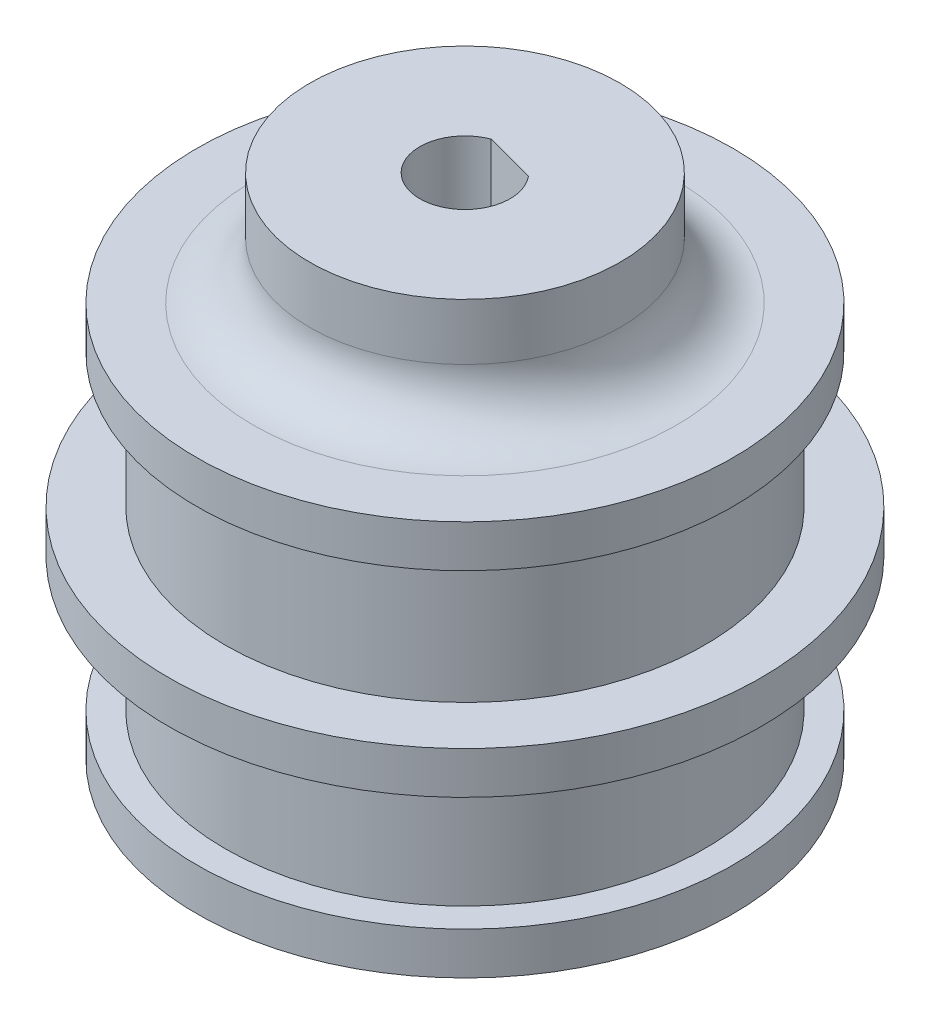
ISO-10303-21;
HEADER;
FILE_DESCRIPTION(('STEP AP214'),'2;1');
FILE_NAME('part.step','',(''),(''),'','','');
FILE_SCHEMA(('AUTOMOTIVE_DESIGN { 1 0 10303 214 1 1 1 1 }'));
ENDSEC;
DATA;
#1=APPLICATION_CONTEXT('core data for automotive mechanical design processes');
#2=APPLICATION_PROTOCOL_DEFINITION('international standard','automotive_design',2000,#1);
#3=PRODUCT_CONTEXT('',#1,'mechanical');
#4=PRODUCT('Part','Part','',(#3));
#5=PRODUCT_RELATED_PRODUCT_CATEGORY('part','',(#4));
#6=PRODUCT_DEFINITION_FORMATION('','',#4);
#7=PRODUCT_DEFINITION_CONTEXT('part definition',#1,'design');
#8=PRODUCT_DEFINITION('design','',#6,#7);
#9=PRODUCT_DEFINITION_SHAPE('','',#8);
#10=(LENGTH_UNIT() NAMED_UNIT(*) SI_UNIT(.MILLI.,.METRE.));
#11=(NAMED_UNIT(*) PLANE_ANGLE_UNIT() SI_UNIT($,.RADIAN.));
#12=(NAMED_UNIT(*) SI_UNIT($,.STERADIAN.) SOLID_ANGLE_UNIT());
#13=UNCERTAINTY_MEASURE_WITH_UNIT(LENGTH_MEASURE(1.E-05),#10,'distance_accuracy_value','');
#14=(GEOMETRIC_REPRESENTATION_CONTEXT(3) GLOBAL_UNCERTAINTY_ASSIGNED_CONTEXT((#13)) GLOBAL_UNIT_ASSIGNED_CONTEXT((#10,
#11,#12)) REPRESENTATION_CONTEXT('',''));
#15=CARTESIAN_POINT('',(0.,0.,0.));
#16=DIRECTION('',(0.,0.,1.));
#17=DIRECTION('',(1.,0.,0.));
#18=AXIS2_PLACEMENT_3D('',#15,#16,#17);
#19=CARTESIAN_POINT('',(7.5,-4.79917699236291,0.));
#20=DIRECTION('',(0.,-1.,0.));
#21=DIRECTION('',(0.,0.,-1.));
#22=AXIS2_PLACEMENT_3D('',#19,#20,#21);
#23=PLANE('',#22);
#24=CARTESIAN_POINT('',(0.,-4.79917699236291,0.));
#25=DIRECTION('',(0.,-1.,0.));
#26=DIRECTION('',(0.,0.,-1.));
#27=AXIS2_PLACEMENT_3D('',#24,#25,#26);
#28=CIRCLE('',#27,9.5);
#29=CARTESIAN_POINT('',(0.,-4.79917699236291,-9.5));
#30=VERTEX_POINT('',#29);
#31=EDGE_CURVE('E113',#30,#30,#28,.T.);
#32=ORIENTED_EDGE('',*,*,#31,.T.);
#33=EDGE_LOOP('',(#32));
#34=FACE_BOUND('',#33,.T.);
#35=CARTESIAN_POINT('',(0.,-4.79917699236291,0.));
#36=DIRECTION('',(0.,-1.,0.));
#37=DIRECTION('',(0.,0.,-1.));
#38=AXIS2_PLACEMENT_3D('',#35,#36,#37);
#39=CIRCLE('',#38,7.5);
#40=CARTESIAN_POINT('',(0.,-4.79917699236291,-7.5));
#41=VERTEX_POINT('',#40);
#42=EDGE_CURVE('E62',#41,#41,#39,.T.);
#43=ORIENTED_EDGE('',*,*,#42,.F.);
#44=EDGE_LOOP('',(#43));
#45=FACE_BOUND('',#44,.T.);
#46=ADVANCED_FACE('F33',(#34,#45),#23,.T.);
#47=CARTESIAN_POINT('',(0.,-15.7831074618265,0.));
#48=DIRECTION('',(0.,-1.,0.));
#49=DIRECTION('',(0.,0.,-1.));
#50=AXIS2_PLACEMENT_3D('',#47,#48,#49);
#51=CYLINDRICAL_SURFACE('',#50,9.5);
#52=CARTESIAN_POINT('',(0.,-3.2991769923629,0.));
#53=DIRECTION('',(0.,-1.,0.));
#54=DIRECTION('',(0.,0.,-1.));
#55=AXIS2_PLACEMENT_3D('',#52,#53,#54);
#56=CIRCLE('',#55,9.5);
#57=CARTESIAN_POINT('',(0.,-3.2991769923629,-9.5));
#58=VERTEX_POINT('',#57);
#59=EDGE_CURVE('E110',#58,#58,#56,.T.);
#60=ORIENTED_EDGE('',*,*,#59,.T.);
#61=EDGE_LOOP('',(#60));
#62=FACE_BOUND('',#61,.T.);
#63=ORIENTED_EDGE('',*,*,#31,.F.);
#64=EDGE_LOOP('',(#63));
#65=FACE_BOUND('',#64,.T.);
#66=ADVANCED_FACE('F139',(#62,#65),#51,.T.);
#67=CARTESIAN_POINT('',(9.5,-3.29917699236291,0.));
#68=DIRECTION('',(0.,1.,0.));
#69=DIRECTION('',(0.,0.,1.));
#70=AXIS2_PLACEMENT_3D('',#67,#68,#69);
#71=PLANE('',#70);
#72=CARTESIAN_POINT('',(0.,-3.29917699236291,0.));
#73=DIRECTION('',(0.,-1.,0.));
#74=DIRECTION('',(0.,0.,-1.));
#75=AXIS2_PLACEMENT_3D('',#72,#73,#74);
#76=CIRCLE('',#75,8.5);
#77=CARTESIAN_POINT('',(0.,-3.29917699236291,-8.5));
#78=VERTEX_POINT('',#77);
#79=EDGE_CURVE('E107',#78,#78,#76,.T.);
#80=ORIENTED_EDGE('',*,*,#79,.T.);
#81=EDGE_LOOP('',(#80));
#82=FACE_BOUND('',#81,.T.);
#83=ORIENTED_EDGE('',*,*,#59,.F.);
#84=EDGE_LOOP('',(#83));
#85=FACE_BOUND('',#84,.T.);
#86=ADVANCED_FACE('F144',(#82,#85),#71,.T.);
#87=CARTESIAN_POINT('',(0.,-15.7831074618265,0.));
#88=DIRECTION('',(0.,-1.,0.));
#89=DIRECTION('',(0.,0.,-1.));
#90=AXIS2_PLACEMENT_3D('',#87,#88,#89);
#91=CYLINDRICAL_SURFACE('',#90,8.5);
#92=CARTESIAN_POINT('',(0.,1.4508230076371,0.));
#93=DIRECTION('',(0.,-1.,0.));
#94=DIRECTION('',(0.,0.,-1.));
#95=AXIS2_PLACEMENT_3D('',#92,#93,#94);
#96=CIRCLE('',#95,8.5);
#97=CARTESIAN_POINT('',(0.,1.4508230076371,-8.5));
#98=VERTEX_POINT('',#97);
#99=EDGE_CURVE('E104',#98,#98,#96,.T.);
#100=ORIENTED_EDGE('',*,*,#99,.T.);
#101=EDGE_LOOP('',(#100));
#102=FACE_BOUND('',#101,.T.);
#103=ORIENTED_EDGE('',*,*,#79,.F.);
#104=EDGE_LOOP('',(#103));
#105=FACE_BOUND('',#104,.T.);
#106=ADVANCED_FACE('F151',(#102,#105),#91,.T.);
#107=CARTESIAN_POINT('',(8.5,1.45082300763709,0.));
#108=DIRECTION('',(0.,-1.,0.));
#109=DIRECTION('',(0.,0.,-1.));
#110=AXIS2_PLACEMENT_3D('',#107,#108,#109);
#111=PLANE('',#110);
#112=CARTESIAN_POINT('',(0.,1.4508230076371,0.));
#113=DIRECTION('',(0.,-1.,0.));
#114=DIRECTION('',(0.,0.,-1.));
#115=AXIS2_PLACEMENT_3D('',#112,#113,#114);
#116=CIRCLE('',#115,10.5);
#117=CARTESIAN_POINT('',(0.,1.4508230076371,-10.5));
#118=VERTEX_POINT('',#117);
#119=EDGE_CURVE('E101',#118,#118,#116,.T.);
#120=ORIENTED_EDGE('',*,*,#119,.T.);
#121=EDGE_LOOP('',(#120));
#122=FACE_BOUND('',#121,.T.);
#123=ORIENTED_EDGE('',*,*,#99,.F.);
#124=EDGE_LOOP('',(#123));
#125=FACE_BOUND('',#124,.T.);
#126=ADVANCED_FACE('F155',(#122,#125),#111,.T.);
#127=CARTESIAN_POINT('',(0.,-15.7831074618265,0.));
#128=DIRECTION('',(0.,-1.,0.));
#129=DIRECTION('',(0.,0.,-1.));
#130=AXIS2_PLACEMENT_3D('',#127,#128,#129);
#131=CYLINDRICAL_SURFACE('',#130,10.5);
#132=CARTESIAN_POINT('',(0.,2.95082300763709,0.));
#133=DIRECTION('',(0.,-1.,0.));
#134=DIRECTION('',(0.,0.,-1.));
#135=AXIS2_PLACEMENT_3D('',#132,#133,#134);
#136=CIRCLE('',#135,10.5);
#137=CARTESIAN_POINT('',(0.,2.95082300763709,-10.5));
#138=VERTEX_POINT('',#137);
#139=EDGE_CURVE('E98',#138,#138,#136,.T.);
#140=ORIENTED_EDGE('',*,*,#139,.T.);
#141=EDGE_LOOP('',(#140));
#142=FACE_BOUND('',#141,.T.);
#143=ORIENTED_EDGE('',*,*,#119,.F.);
#144=EDGE_LOOP('',(#143));
#145=FACE_BOUND('',#144,.T.);
#146=ADVANCED_FACE('F159',(#142,#145),#131,.T.);
#147=CARTESIAN_POINT('',(10.5,2.95082300763709,0.));
#148=DIRECTION('',(0.,1.,0.));
#149=DIRECTION('',(0.,0.,1.));
#150=AXIS2_PLACEMENT_3D('',#147,#148,#149);
#151=PLANE('',#150);
#152=CARTESIAN_POINT('',(0.,2.95082300763709,0.));
#153=DIRECTION('',(0.,-1.,0.));
#154=DIRECTION('',(0.,0.,-1.));
#155=AXIS2_PLACEMENT_3D('',#152,#153,#154);
#156=CIRCLE('',#155,8.5);
#157=CARTESIAN_POINT('',(0.,2.95082300763709,-8.5));
#158=VERTEX_POINT('',#157);
#159=EDGE_CURVE('E95',#158,#158,#156,.T.);
#160=ORIENTED_EDGE('',*,*,#159,.T.);
#161=EDGE_LOOP('',(#160));
#162=FACE_BOUND('',#161,.T.);
#163=ORIENTED_EDGE('',*,*,#139,.F.);
#164=EDGE_LOOP('',(#163));
#165=FACE_BOUND('',#164,.T.);
#166=ADVANCED_FACE('F163',(#162,#165),#151,.T.);
#167=CARTESIAN_POINT('',(0.,-15.7831074618265,0.));
#168=DIRECTION('',(0.,-1.,0.));
#169=DIRECTION('',(0.,0.,-1.));
#170=AXIS2_PLACEMENT_3D('',#167,#168,#169);
#171=CYLINDRICAL_SURFACE('',#170,8.5);
#172=CARTESIAN_POINT('',(0.,7.7008230076371,0.));
#173=DIRECTION('',(0.,-1.,0.));
#174=DIRECTION('',(0.,0.,-1.));
#175=AXIS2_PLACEMENT_3D('',#172,#173,#174);
#176=CIRCLE('',#175,8.5);
#177=CARTESIAN_POINT('',(0.,7.7008230076371,-8.5));
#178=VERTEX_POINT('',#177);
#179=EDGE_CURVE('E92',#178,#178,#176,.T.);
#180=ORIENTED_EDGE('',*,*,#179,.T.);
#181=EDGE_LOOP('',(#180));
#182=FACE_BOUND('',#181,.T.);
#183=ORIENTED_EDGE('',*,*,#159,.F.);
#184=EDGE_LOOP('',(#183));
#185=FACE_BOUND('',#184,.T.);
#186=ADVANCED_FACE('F167',(#182,#185),#171,.T.);
#187=CARTESIAN_POINT('',(8.5,7.7008230076371,0.));
#188=DIRECTION('',(0.,-1.,0.));
#189=DIRECTION('',(0.,0.,-1.));
#190=AXIS2_PLACEMENT_3D('',#187,#188,#189);
#191=PLANE('',#190);
#192=CARTESIAN_POINT('',(0.,7.7008230076371,0.));
#193=DIRECTION('',(0.,-1.,0.));
#194=DIRECTION('',(0.,0.,-1.));
#195=AXIS2_PLACEMENT_3D('',#192,#193,#194);
#196=CIRCLE('',#195,9.5);
#197=CARTESIAN_POINT('',(0.,7.7008230076371,-9.5));
#198=VERTEX_POINT('',#197);
#199=EDGE_CURVE('E89',#198,#198,#196,.T.);
#200=ORIENTED_EDGE('',*,*,#199,.T.);
#201=EDGE_LOOP('',(#200));
#202=FACE_BOUND('',#201,.T.);
#203=ORIENTED_EDGE('',*,*,#179,.F.);
#204=EDGE_LOOP('',(#203));
#205=FACE_BOUND('',#204,.T.);
#206=ADVANCED_FACE('F171',(#202,#205),#191,.T.);
#207=CARTESIAN_POINT('',(0.,-15.7831074618265,0.));
#208=DIRECTION('',(0.,-1.,0.));
#209=DIRECTION('',(0.,0.,-1.));
#210=AXIS2_PLACEMENT_3D('',#207,#208,#209);
#211=CYLINDRICAL_SURFACE('',#210,9.5);
#212=CARTESIAN_POINT('',(0.,9.2008230076371,0.));
#213=DIRECTION('',(0.,-1.,0.));
#214=DIRECTION('',(0.,0.,-1.));
#215=AXIS2_PLACEMENT_3D('',#212,#213,#214);
#216=CIRCLE('',#215,9.5);
#217=CARTESIAN_POINT('',(0.,9.2008230076371,-9.5));
#218=VERTEX_POINT('',#217);
#219=EDGE_CURVE('E86',#218,#218,#216,.T.);
#220=ORIENTED_EDGE('',*,*,#219,.T.);
#221=EDGE_LOOP('',(#220));
#222=FACE_BOUND('',#221,.T.);
#223=ORIENTED_EDGE('',*,*,#199,.F.);
#224=EDGE_LOOP('',(#223));
#225=FACE_BOUND('',#224,.T.);
#226=ADVANCED_FACE('F175',(#222,#225),#211,.T.);
#227=CARTESIAN_POINT('',(9.5,9.2008230076371,0.));
#228=DIRECTION('',(0.,1.,0.));
#229=DIRECTION('',(0.,0.,1.));
#230=AXIS2_PLACEMENT_3D('',#227,#228,#229);
#231=PLANE('',#230);
#232=CARTESIAN_POINT('',(0.,9.2008230076371,0.));
#233=DIRECTION('',(0.,1.,0.));
#234=DIRECTION('',(0.,0.,1.));
#235=AXIS2_PLACEMENT_3D('',#232,#233,#234);
#236=CIRCLE('',#235,7.5);
#237=CARTESIAN_POINT('',(0.,9.2008230076371,7.5));
#238=VERTEX_POINT('',#237);
#239=EDGE_CURVE('E116',#238,#238,#236,.F.);
#240=ORIENTED_EDGE('',*,*,#239,.T.);
#241=EDGE_LOOP('',(#240));
#242=FACE_BOUND('',#241,.T.);
#243=ORIENTED_EDGE('',*,*,#219,.F.);
#244=EDGE_LOOP('',(#243));
#245=FACE_BOUND('',#244,.T.);
#246=ADVANCED_FACE('F179',(#242,#245),#231,.T.);
#247=CARTESIAN_POINT('',(0.,-15.7831074618265,0.));
#248=DIRECTION('',(0.,-1.,0.));
#249=DIRECTION('',(0.,0.,-1.));
#250=AXIS2_PLACEMENT_3D('',#247,#248,#249);
#251=CYLINDRICAL_SURFACE('',#250,5.5);
#252=CARTESIAN_POINT('',(0.,11.2008230076371,0.));
#253=DIRECTION('',(0.,1.,0.));
#254=DIRECTION('',(0.,0.,1.));
#255=AXIS2_PLACEMENT_3D('',#252,#253,#254);
#256=CIRCLE('',#255,5.5);
#257=CARTESIAN_POINT('',(0.,11.2008230076371,5.5));
#258=VERTEX_POINT('',#257);
#259=EDGE_CURVE('E119',#258,#258,#256,.T.);
#260=ORIENTED_EDGE('',*,*,#259,.T.);
#261=EDGE_LOOP('',(#260));
#262=FACE_BOUND('',#261,.T.);
#263=CARTESIAN_POINT('',(0.,13.2008230076371,0.));
#264=DIRECTION('',(0.,-1.,0.));
#265=DIRECTION('',(0.,0.,-1.));
#266=AXIS2_PLACEMENT_3D('',#263,#264,#265);
#267=CIRCLE('',#266,5.5);
#268=CARTESIAN_POINT('',(0.,13.2008230076371,-5.5));
#269=VERTEX_POINT('',#268);
#270=EDGE_CURVE('E83',#269,#269,#267,.T.);
#271=ORIENTED_EDGE('',*,*,#270,.T.);
#272=EDGE_LOOP('',(#271));
#273=FACE_BOUND('',#272,.T.);
#274=ADVANCED_FACE('F183',(#262,#273),#251,.T.);
#275=CARTESIAN_POINT('',(5.5,13.2008230076371,0.));
#276=DIRECTION('',(0.,1.,0.));
#277=DIRECTION('',(0.,0.,1.));
#278=AXIS2_PLACEMENT_3D('',#275,#276,#277);
#279=PLANE('',#278);
#280=CARTESIAN_POINT('',(0.,13.2008230076371,0.));
#281=DIRECTION('',(0.,1.,0.));
#282=DIRECTION('',(0.,0.,-1.));
#283=AXIS2_PLACEMENT_3D('',#280,#281,#282);
#284=CIRCLE('',#283,1.6);
#285=CARTESIAN_POINT('',(-0.568761348028621,13.2008230076371,-1.4954967499091));
#286=VERTEX_POINT('',#285);
#287=CARTESIAN_POINT('',(1.23452055077082,13.2008230076371,-1.01782071590458));
#288=VERTEX_POINT('',#287);
#289=EDGE_CURVE('E48',#286,#288,#284,.T.);
#290=ORIENTED_EDGE('',*,*,#289,.F.);
#291=DIRECTION('',(-0.96666056377449,0.,-0.256061231823923));
#292=VECTOR('',#291,1.);
#293=CARTESIAN_POINT('',(-0.568761348028621,13.2008230076371,-1.4954967499091));
#294=LINE('',#293,#292);
#295=EDGE_CURVE('E66',#288,#286,#294,.T.);
#296=ORIENTED_EDGE('',*,*,#295,.F.);
#297=EDGE_LOOP('',(#290,#296));
#298=FACE_BOUND('',#297,.T.);
#299=ORIENTED_EDGE('',*,*,#270,.F.);
#300=EDGE_LOOP('',(#299));
#301=FACE_BOUND('',#300,.T.);
#302=ADVANCED_FACE('F70',(#298,#301),#279,.T.);
#303=CARTESIAN_POINT('',(3.49999999999997,4.20082300763709,0.));
#304=DIRECTION('',(0.,-1.,0.));
#305=DIRECTION('',(0.,0.,-1.));
#306=AXIS2_PLACEMENT_3D('',#303,#304,#305);
#307=PLANE('',#306);
#308=CARTESIAN_POINT('',(0.,4.20082300763709,0.));
#309=DIRECTION('',(0.,-1.,0.));
#310=DIRECTION('',(0.,0.,-1.));
#311=AXIS2_PLACEMENT_3D('',#308,#309,#310);
#312=CIRCLE('',#311,1.6);
#313=CARTESIAN_POINT('',(1.23452055077082,4.20082300763709,-1.01782071590458));
#314=VERTEX_POINT('',#313);
#315=CARTESIAN_POINT('',(-0.568761348028621,4.20082300763709,-1.4954967499091));
#316=VERTEX_POINT('',#315);
#317=EDGE_CURVE('E11',#314,#316,#312,.T.);
#318=ORIENTED_EDGE('',*,*,#317,.F.);
#319=DIRECTION('',(0.96666056377449,0.,0.256061231823923));
#320=VECTOR('',#319,1.);
#321=CARTESIAN_POINT('',(3.60339386081993,4.20082300763709,-0.390323701401882));
#322=LINE('',#321,#320);
#323=EDGE_CURVE('E41',#316,#314,#322,.T.);
#324=ORIENTED_EDGE('',*,*,#323,.F.);
#325=EDGE_LOOP('',(#318,#324));
#326=FACE_BOUND('',#325,.T.);
#327=CARTESIAN_POINT('',(0.,4.20082300763709,0.));
#328=DIRECTION('',(0.,-1.,0.));
#329=DIRECTION('',(0.,0.,-1.));
#330=AXIS2_PLACEMENT_3D('',#327,#328,#329);
#331=CIRCLE('',#330,3.49999999999997);
#332=CARTESIAN_POINT('',(0.,4.20082300763709,-3.49999999999997));
#333=VERTEX_POINT('',#332);
#334=EDGE_CURVE('E80',#333,#333,#331,.T.);
#335=ORIENTED_EDGE('',*,*,#334,.T.);
#336=EDGE_LOOP('',(#335));
#337=FACE_BOUND('',#336,.T.);
#338=ADVANCED_FACE('F122',(#326,#337),#307,.T.);
#339=CARTESIAN_POINT('',(0.,0.200823007637093,0.));
#340=DIRECTION('',(0.,-1.,0.));
#341=DIRECTION('',(0.,0.,-1.));
#342=AXIS2_PLACEMENT_3D('',#339,#340,#341);
#343=DEGENERATE_TOROIDAL_SURFACE('',#342,3.5,4.,.T.);
#344=CARTESIAN_POINT('',(0.,0.200823007637064,0.));
#345=DIRECTION('',(0.,-1.,0.));
#346=DIRECTION('',(0.,0.,-1.));
#347=AXIS2_PLACEMENT_3D('',#344,#345,#346);
#348=CIRCLE('',#347,7.5);
#349=CARTESIAN_POINT('',(0.,0.200823007637064,-7.5));
#350=VERTEX_POINT('',#349);
#351=EDGE_CURVE('E77',#350,#350,#348,.T.);
#352=ORIENTED_EDGE('',*,*,#351,.T.);
#353=EDGE_LOOP('',(#352));
#354=FACE_BOUND('',#353,.T.);
#355=ORIENTED_EDGE('',*,*,#334,.F.);
#356=EDGE_LOOP('',(#355));
#357=FACE_BOUND('',#356,.T.);
#358=ADVANCED_FACE('F125',(#354,#357),#343,.F.);
#359=CARTESIAN_POINT('',(0.,-15.7831074618265,0.));
#360=DIRECTION('',(0.,-1.,0.));
#361=DIRECTION('',(0.,0.,-1.));
#362=AXIS2_PLACEMENT_3D('',#359,#360,#361);
#363=CYLINDRICAL_SURFACE('',#362,7.5);
#364=ORIENTED_EDGE('',*,*,#42,.T.);
#365=EDGE_LOOP('',(#364));
#366=FACE_BOUND('',#365,.T.);
#367=ORIENTED_EDGE('',*,*,#351,.F.);
#368=EDGE_LOOP('',(#367));
#369=FACE_BOUND('',#368,.T.);
#370=ADVANCED_FACE('F130',(#366,#369),#363,.F.);
#371=CARTESIAN_POINT('',(0.,11.2008230076371,0.));
#372=DIRECTION('',(0.,1.,0.));
#373=DIRECTION('',(0.,0.,1.));
#374=AXIS2_PLACEMENT_3D('',#371,#372,#373);
#375=TOROIDAL_SURFACE('',#374,7.5,2.);
#376=ORIENTED_EDGE('',*,*,#259,.F.);
#377=EDGE_LOOP('',(#376));
#378=FACE_BOUND('',#377,.T.);
#379=ORIENTED_EDGE('',*,*,#239,.F.);
#380=EDGE_LOOP('',(#379));
#381=FACE_BOUND('',#380,.T.);
#382=ADVANCED_FACE('F35',(#378,#381),#375,.F.);
#383=CARTESIAN_POINT('',(0.,-4.79917699236291,0.));
#384=DIRECTION('',(0.,1.,0.));
#385=DIRECTION('',(0.,0.,1.));
#386=AXIS2_PLACEMENT_3D('',#383,#384,#385);
#387=CYLINDRICAL_SURFACE('',#386,1.6);
#388=ORIENTED_EDGE('',*,*,#317,.T.);
#389=DIRECTION('',(0.,1.,0.));
#390=VECTOR('',#389,1.);
#391=CARTESIAN_POINT('',(-0.568761348028621,-4.79917699236291,-1.4954967499091));
#392=LINE('',#391,#390);
#393=EDGE_CURVE('E55',#316,#286,#392,.T.);
#394=ORIENTED_EDGE('',*,*,#393,.T.);
#395=ORIENTED_EDGE('',*,*,#289,.T.);
#396=DIRECTION('',(0.,1.,0.));
#397=VECTOR('',#396,1.);
#398=CARTESIAN_POINT('',(1.23452055077082,-4.79917699236291,-1.01782071590458));
#399=LINE('',#398,#397);
#400=EDGE_CURVE('E63',#314,#288,#399,.T.);
#401=ORIENTED_EDGE('',*,*,#400,.F.);
#402=EDGE_LOOP('',(#388,#394,#395,#401));
#403=FACE_BOUND('',#402,.T.);
#404=ADVANCED_FACE('F59',(#403),#387,.F.);
#405=CARTESIAN_POINT('',(-0.568761348028621,-4.79917699236291,-1.4954967499091));
#406=DIRECTION('',(0.256061231823923,0.,-0.96666056377449));
#407=DIRECTION('',(-0.96666056377449,0.,-0.256061231823923));
#408=AXIS2_PLACEMENT_3D('',#405,#406,#407);
#409=PLANE('',#408);
#410=ORIENTED_EDGE('',*,*,#323,.T.);
#411=ORIENTED_EDGE('',*,*,#400,.T.);
#412=ORIENTED_EDGE('',*,*,#295,.T.);
#413=ORIENTED_EDGE('',*,*,#393,.F.);
#414=EDGE_LOOP('',(#410,#411,#412,#413));
#415=FACE_BOUND('',#414,.T.);
#416=ADVANCED_FACE('F67',(#415),#409,.F.);
#417=CLOSED_SHELL('',(#46,#66,#86,#106,#126,#146,#166,#186,#206,#226,#246,#274,#302,#338,#358,
#370,#382,#404,#416));
#418=MANIFOLD_SOLID_BREP('B2',#417);
#419=ADVANCED_BREP_SHAPE_REPRESENTATION('',(#18,#418),#14);
#420=SHAPE_DEFINITION_REPRESENTATION(#9,#419);
ENDSEC;
END-ISO-10303-21;
